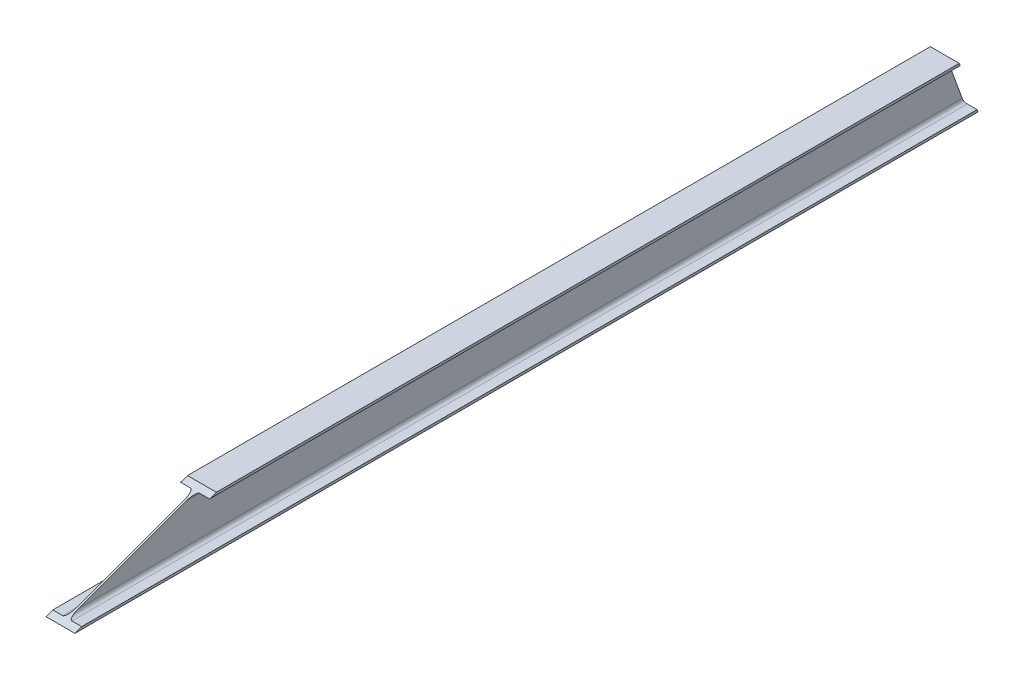
ISO-10303-21;
HEADER;
FILE_DESCRIPTION(('STEP AP214'),'2;1');
FILE_NAME('part.step','',(''),(''),'','','');
FILE_SCHEMA(('AUTOMOTIVE_DESIGN { 1 0 10303 214 1 1 1 1 }'));
ENDSEC;
DATA;
#1=APPLICATION_CONTEXT('core data for automotive mechanical design processes');
#2=APPLICATION_PROTOCOL_DEFINITION('international standard','automotive_design',2000,#1);
#3=PRODUCT_CONTEXT('',#1,'mechanical');
#4=PRODUCT('Part','Part','',(#3));
#5=PRODUCT_RELATED_PRODUCT_CATEGORY('part','',(#4));
#6=PRODUCT_DEFINITION_FORMATION('','',#4);
#7=PRODUCT_DEFINITION_CONTEXT('part definition',#1,'design');
#8=PRODUCT_DEFINITION('design','',#6,#7);
#9=PRODUCT_DEFINITION_SHAPE('','',#8);
#10=(LENGTH_UNIT() NAMED_UNIT(*) SI_UNIT(.MILLI.,.METRE.));
#11=(NAMED_UNIT(*) PLANE_ANGLE_UNIT() SI_UNIT($,.RADIAN.));
#12=(NAMED_UNIT(*) SI_UNIT($,.STERADIAN.) SOLID_ANGLE_UNIT());
#13=UNCERTAINTY_MEASURE_WITH_UNIT(LENGTH_MEASURE(1.E-05),#10,'distance_accuracy_value','');
#14=(GEOMETRIC_REPRESENTATION_CONTEXT(3) GLOBAL_UNCERTAINTY_ASSIGNED_CONTEXT((#13)) GLOBAL_UNIT_ASSIGNED_CONTEXT((#10,
#11,#12)) REPRESENTATION_CONTEXT('',''));
#15=CARTESIAN_POINT('',(0.,0.,0.));
#16=DIRECTION('',(0.,0.,1.));
#17=DIRECTION('',(1.,0.,0.));
#18=AXIS2_PLACEMENT_3D('',#15,#16,#17);
#19=CARTESIAN_POINT('',(-27.5,44.3,1726.35054737602));
#20=DIRECTION('',(1.,0.,0.));
#21=DIRECTION('',(0.,1.,0.));
#22=AXIS2_PLACEMENT_3D('',#19,#20,#21);
#23=PLANE('',#22);
#24=DIRECTION('',(0.,0.,-1.));
#25=VECTOR('',#24,1.);
#26=CARTESIAN_POINT('',(-27.5,44.3,1726.35054737602));
#27=LINE('',#26,#25);
#28=CARTESIAN_POINT('',(-27.5,44.3,1462.58444096448));
#29=VERTEX_POINT('',#28);
#30=CARTESIAN_POINT('',(-27.5,44.3,33.9584228570368));
#31=VERTEX_POINT('',#30);
#32=EDGE_CURVE('E45',#29,#31,#27,.T.);
#33=ORIENTED_EDGE('',*,*,#32,.F.);
#34=DIRECTION('',(0.,0.342020143325666,-0.939692620785909));
#35=VECTOR('',#34,1.);
#36=CARTESIAN_POINT('',(-27.5000000000001,-40.4727925282967,1695.49577422009));
#37=LINE('',#36,#35);
#38=CARTESIAN_POINT('',(-27.5,49.,1449.67129709305));
#39=VERTEX_POINT('',#38);
#40=EDGE_CURVE('E293',#29,#39,#37,.T.);
#41=ORIENTED_EDGE('',*,*,#40,.T.);
#42=DIRECTION('',(0.,0.,-1.));
#43=VECTOR('',#42,1.);
#44=CARTESIAN_POINT('',(-27.5,49.,1726.35054737602));
#45=LINE('',#44,#43);
#46=CARTESIAN_POINT('',(-27.5,49.,35.6690829580877));
#47=VERTEX_POINT('',#46);
#48=EDGE_CURVE('E202',#39,#47,#45,.T.);
#49=ORIENTED_EDGE('',*,*,#48,.T.);
#50=DIRECTION('',(0.,0.939692620785908,0.342020143325669));
#51=VECTOR('',#50,1.);
#52=CARTESIAN_POINT('',(-27.4999999999996,588.22434418594,231.930693833484));
#53=LINE('',#52,#51);
#54=EDGE_CURVE('E195',#31,#47,#53,.T.);
#55=ORIENTED_EDGE('',*,*,#54,.F.);
#56=EDGE_LOOP('',(#33,#41,#49,#55));
#57=FACE_BOUND('',#56,.T.);
#58=ADVANCED_FACE('F38',(#57),#23,.F.);
#59=CARTESIAN_POINT('',(-8.8,44.3,1726.35054737602));
#60=DIRECTION('',(0.,1.,0.));
#61=DIRECTION('',(0.,0.,1.));
#62=AXIS2_PLACEMENT_3D('',#59,#60,#61);
#63=PLANE('',#62);
#64=DIRECTION('',(0.,0.,-1.));
#65=VECTOR('',#64,1.);
#66=CARTESIAN_POINT('',(-8.8,44.3,1726.35054737602));
#67=LINE('',#66,#65);
#68=CARTESIAN_POINT('',(-8.8,44.3,1462.58444096448));
#69=VERTEX_POINT('',#68);
#70=CARTESIAN_POINT('',(-8.8,44.3,33.9584228570367));
#71=VERTEX_POINT('',#70);
#72=EDGE_CURVE('E176',#69,#71,#67,.T.);
#73=ORIENTED_EDGE('',*,*,#72,.F.);
#74=DIRECTION('',(-1.,0.,0.));
#75=VECTOR('',#74,1.);
#76=CARTESIAN_POINT('',(-8.8,44.3,1462.58444096448));
#77=LINE('',#76,#75);
#78=EDGE_CURVE('E185',#69,#29,#77,.T.);
#79=ORIENTED_EDGE('',*,*,#78,.T.);
#80=ORIENTED_EDGE('',*,*,#32,.T.);
#81=DIRECTION('',(-1.,0.,0.));
#82=VECTOR('',#81,1.);
#83=CARTESIAN_POINT('',(-8.8,44.3,33.9584228570367));
#84=LINE('',#83,#82);
#85=EDGE_CURVE('E184',#71,#31,#84,.T.);
#86=ORIENTED_EDGE('',*,*,#85,.F.);
#87=EDGE_LOOP('',(#73,#79,#80,#86));
#88=FACE_BOUND('',#87,.T.);
#89=ADVANCED_FACE('F183',(#88),#63,.F.);
#90=CARTESIAN_POINT('',(-8.8,37.3,1726.35054737602));
#91=DIRECTION('',(0.,0.,-1.));
#92=DIRECTION('',(-1.,0.,0.));
#93=AXIS2_PLACEMENT_3D('',#90,#91,#92);
#94=CYLINDRICAL_SURFACE('',#93,7.);
#95=DIRECTION('',(0.,0.,-1.));
#96=VECTOR('',#95,1.);
#97=CARTESIAN_POINT('',(-1.8,37.3,1726.35054737602));
#98=LINE('',#97,#96);
#99=CARTESIAN_POINT('',(-1.8,37.3,1481.81678290066));
#100=VERTEX_POINT('',#99);
#101=CARTESIAN_POINT('',(-1.8,37.3,31.4106312171734));
#102=VERTEX_POINT('',#101);
#103=EDGE_CURVE('E174',#100,#102,#98,.T.);
#104=ORIENTED_EDGE('',*,*,#103,.F.);
#105=CARTESIAN_POINT('',(-8.8,37.3,1481.81678290067));
#106=DIRECTION('',(0.,-0.939692620785909,-0.342020143325666));
#107=DIRECTION('',(0.,0.342020143325666,-0.939692620785909));
#108=AXIS2_PLACEMENT_3D('',#105,#106,#107);
#109=ELLIPSE('',#108,20.4666308011418,7.);
#110=EDGE_CURVE('E296',#100,#69,#109,.F.);
#111=ORIENTED_EDGE('',*,*,#110,.T.);
#112=ORIENTED_EDGE('',*,*,#72,.T.);
#113=CARTESIAN_POINT('',(-8.8,37.3,31.4106312171734));
#114=DIRECTION('',(0.,0.342020143325669,-0.939692620785908));
#115=DIRECTION('',(0.,-0.939692620785908,-0.342020143325669));
#116=AXIS2_PLACEMENT_3D('',#113,#114,#115);
#117=ELLIPSE('',#116,7.44924440733139,7.);
#118=EDGE_CURVE('E199',#102,#71,#117,.F.);
#119=ORIENTED_EDGE('',*,*,#118,.F.);
#120=EDGE_LOOP('',(#104,#111,#112,#119));
#121=FACE_BOUND('',#120,.T.);
#122=ADVANCED_FACE('F325',(#121),#94,.F.);
#123=CARTESIAN_POINT('',(-1.8,-37.3,1726.35054737602));
#124=DIRECTION('',(1.,0.,0.));
#125=DIRECTION('',(0.,0.,-1.));
#126=AXIS2_PLACEMENT_3D('',#123,#124,#125);
#127=PLANE('',#126);
#128=DIRECTION('',(0.,0.,-1.));
#129=VECTOR('',#128,1.);
#130=CARTESIAN_POINT('',(-1.8,-37.3,1726.35054737602));
#131=LINE('',#130,#129);
#132=CARTESIAN_POINT('',(-1.8,-37.3,1686.77859839198));
#133=VERTEX_POINT('',#132);
#134=CARTESIAN_POINT('',(-1.8,-37.3,4.25845174091469));
#135=VERTEX_POINT('',#134);
#136=EDGE_CURVE('E172',#133,#135,#131,.T.);
#137=ORIENTED_EDGE('',*,*,#136,.F.);
#138=DIRECTION('',(0.,0.342020143325666,-0.939692620785909));
#139=VECTOR('',#138,1.);
#140=CARTESIAN_POINT('',(-1.8,-50.0181792490422,1721.7215086953));
#141=LINE('',#140,#139);
#142=EDGE_CURVE('E299',#133,#100,#141,.T.);
#143=ORIENTED_EDGE('',*,*,#142,.T.);
#144=ORIENTED_EDGE('',*,*,#103,.T.);
#145=DIRECTION('',(0.,0.939692620785908,0.342020143325669));
#146=VECTOR('',#145,1.);
#147=CARTESIAN_POINT('',(-1.8,516.169730906686,205.704959358274));
#148=LINE('',#147,#146);
#149=EDGE_CURVE('E210',#135,#102,#148,.T.);
#150=ORIENTED_EDGE('',*,*,#149,.F.);
#151=EDGE_LOOP('',(#137,#143,#144,#150));
#152=FACE_BOUND('',#151,.T.);
#153=ADVANCED_FACE('F322',(#152),#127,.F.);
#154=CARTESIAN_POINT('',(-8.8,-37.3,1726.35054737602));
#155=DIRECTION('',(0.,0.,-1.));
#156=DIRECTION('',(-1.,0.,0.));
#157=AXIS2_PLACEMENT_3D('',#154,#155,#156);
#158=CYLINDRICAL_SURFACE('',#157,7.);
#159=DIRECTION('',(0.,0.,-1.));
#160=VECTOR('',#159,1.);
#161=CARTESIAN_POINT('',(-8.8,-44.3,1726.35054737602));
#162=LINE('',#161,#160);
#163=CARTESIAN_POINT('',(-8.8,-44.3,1706.01094032816));
#164=VERTEX_POINT('',#163);
#165=CARTESIAN_POINT('',(-8.8,-44.3,1.71066010105103));
#166=VERTEX_POINT('',#165);
#167=EDGE_CURVE('E170',#164,#166,#162,.T.);
#168=ORIENTED_EDGE('',*,*,#167,.F.);
#169=CARTESIAN_POINT('',(-8.8,-37.3,1686.77859839198));
#170=DIRECTION('',(0.,-0.939692620785909,-0.342020143325666));
#171=DIRECTION('',(0.,0.342020143325666,-0.939692620785909));
#172=AXIS2_PLACEMENT_3D('',#169,#170,#171);
#173=ELLIPSE('',#172,20.4666308011418,7.);
#174=EDGE_CURVE('E302',#164,#133,#173,.F.);
#175=ORIENTED_EDGE('',*,*,#174,.T.);
#176=ORIENTED_EDGE('',*,*,#136,.T.);
#177=CARTESIAN_POINT('',(-8.8,-37.3,4.25845174091455));
#178=DIRECTION('',(0.,0.342020143325669,-0.939692620785908));
#179=DIRECTION('',(0.,-0.939692620785908,-0.342020143325669));
#180=AXIS2_PLACEMENT_3D('',#177,#178,#179);
#181=ELLIPSE('',#180,7.44924440733139,7.);
#182=EDGE_CURVE('E212',#166,#135,#181,.F.);
#183=ORIENTED_EDGE('',*,*,#182,.F.);
#184=EDGE_LOOP('',(#168,#175,#176,#183));
#185=FACE_BOUND('',#184,.T.);
#186=ADVANCED_FACE('F319',(#185),#158,.F.);
#187=CARTESIAN_POINT('',(-27.5,-44.3,1726.35054737602));
#188=DIRECTION('',(0.,-1.,0.));
#189=DIRECTION('',(1.,0.,0.));
#190=AXIS2_PLACEMENT_3D('',#187,#188,#189);
#191=PLANE('',#190);
#192=DIRECTION('',(0.,0.,-1.));
#193=VECTOR('',#192,1.);
#194=CARTESIAN_POINT('',(-27.5,-44.3,1726.35054737602));
#195=LINE('',#194,#193);
#196=CARTESIAN_POINT('',(-27.5,-44.3,1706.01094032816));
#197=VERTEX_POINT('',#196);
#198=CARTESIAN_POINT('',(-27.5,-44.3,1.71066010105103));
#199=VERTEX_POINT('',#198);
#200=EDGE_CURVE('E163',#197,#199,#195,.T.);
#201=ORIENTED_EDGE('',*,*,#200,.F.);
#202=DIRECTION('',(1.,0.,0.));
#203=VECTOR('',#202,1.);
#204=CARTESIAN_POINT('',(-27.5,-44.3,1706.01094032816));
#205=LINE('',#204,#203);
#206=EDGE_CURVE('E305',#197,#164,#205,.T.);
#207=ORIENTED_EDGE('',*,*,#206,.T.);
#208=ORIENTED_EDGE('',*,*,#167,.T.);
#209=DIRECTION('',(1.,0.,0.));
#210=VECTOR('',#209,1.);
#211=CARTESIAN_POINT('',(-27.5000000000002,-44.3,1.71066010105103));
#212=LINE('',#211,#210);
#213=EDGE_CURVE('E215',#199,#166,#212,.T.);
#214=ORIENTED_EDGE('',*,*,#213,.F.);
#215=EDGE_LOOP('',(#201,#207,#208,#214));
#216=FACE_BOUND('',#215,.T.);
#217=ADVANCED_FACE('F314',(#216),#191,.F.);
#218=CARTESIAN_POINT('',(-27.5,-49.,1726.35054737602));
#219=DIRECTION('',(1.,0.,0.));
#220=DIRECTION('',(0.,0.,-1.));
#221=AXIS2_PLACEMENT_3D('',#218,#219,#220);
#222=PLANE('',#221);
#223=DIRECTION('',(0.,0.,-1.));
#224=VECTOR('',#223,1.);
#225=CARTESIAN_POINT('',(-27.5,-49.,1726.35054737602));
#226=LINE('',#225,#224);
#227=CARTESIAN_POINT('',(-27.5,-49.,1718.9240841996));
#228=VERTEX_POINT('',#227);
#229=CARTESIAN_POINT('',(-27.5,-49.,0.));
#230=VERTEX_POINT('',#229);
#231=EDGE_CURVE('E161',#228,#230,#226,.T.);
#232=ORIENTED_EDGE('',*,*,#231,.F.);
#233=DIRECTION('',(0.,0.342020143325666,-0.939692620785909));
#234=VECTOR('',#233,1.);
#235=CARTESIAN_POINT('',(-27.5,-51.3868192567961,1725.48181621197));
#236=LINE('',#235,#234);
#237=EDGE_CURVE('E52',#228,#197,#236,.T.);
#238=ORIENTED_EDGE('',*,*,#237,.T.);
#239=ORIENTED_EDGE('',*,*,#200,.T.);
#240=DIRECTION('',(0.,0.939692620785908,0.342020143325669));
#241=VECTOR('',#240,1.);
#242=CARTESIAN_POINT('',(-27.5,505.83837091444,201.944651841607));
#243=LINE('',#242,#241);
#244=EDGE_CURVE('E218',#230,#199,#243,.T.);
#245=ORIENTED_EDGE('',*,*,#244,.F.);
#246=EDGE_LOOP('',(#232,#238,#239,#245));
#247=FACE_BOUND('',#246,.T.);
#248=ADVANCED_FACE('F310',(#247),#222,.F.);
#249=CARTESIAN_POINT('',(27.5,-44.3,1726.35054737602));
#250=DIRECTION('',(-1.,0.,0.));
#251=DIRECTION('',(0.,0.,1.));
#252=AXIS2_PLACEMENT_3D('',#249,#250,#251);
#253=PLANE('',#252);
#254=DIRECTION('',(0.,0.,-1.));
#255=VECTOR('',#254,1.);
#256=CARTESIAN_POINT('',(27.5,-44.3,1726.35054737602));
#257=LINE('',#256,#255);
#258=CARTESIAN_POINT('',(27.5,-44.3,1706.01094032816));
#259=VERTEX_POINT('',#258);
#260=CARTESIAN_POINT('',(27.5,-44.3,1.71066010105134));
#261=VERTEX_POINT('',#260);
#262=EDGE_CURVE('E155',#259,#261,#257,.T.);
#263=ORIENTED_EDGE('',*,*,#262,.F.);
#264=DIRECTION('',(0.,-0.342020143325666,0.939692620785909));
#265=VECTOR('',#264,1.);
#266=CARTESIAN_POINT('',(27.5,-50.8370236981257,1723.9712653292));
#267=LINE('',#266,#265);
#268=CARTESIAN_POINT('',(27.5,-49.,1718.9240841996));
#269=VERTEX_POINT('',#268);
#270=EDGE_CURVE('E149',#259,#269,#267,.T.);
#271=ORIENTED_EDGE('',*,*,#270,.T.);
#272=DIRECTION('',(0.,0.,-1.));
#273=VECTOR('',#272,1.);
#274=CARTESIAN_POINT('',(27.5,-49.,1726.35054737602));
#275=LINE('',#274,#273);
#276=CARTESIAN_POINT('',(27.5,-49.,0.));
#277=VERTEX_POINT('',#276);
#278=EDGE_CURVE('E59',#269,#277,#275,.T.);
#279=ORIENTED_EDGE('',*,*,#278,.T.);
#280=DIRECTION('',(0.,-0.939692620785908,-0.342020143325669));
#281=VECTOR('',#280,1.);
#282=CARTESIAN_POINT('',(27.5,509.988575355769,203.455202724371));
#283=LINE('',#282,#281);
#284=EDGE_CURVE('E250',#261,#277,#283,.T.);
#285=ORIENTED_EDGE('',*,*,#284,.F.);
#286=EDGE_LOOP('',(#263,#271,#279,#285));
#287=FACE_BOUND('',#286,.T.);
#288=ADVANCED_FACE('F154',(#287),#253,.F.);
#289=CARTESIAN_POINT('',(8.80000000000001,-44.3,1726.35054737602));
#290=DIRECTION('',(0.,-1.,0.));
#291=DIRECTION('',(1.,0.,0.));
#292=AXIS2_PLACEMENT_3D('',#289,#290,#291);
#293=PLANE('',#292);
#294=DIRECTION('',(0.,0.,-1.));
#295=VECTOR('',#294,1.);
#296=CARTESIAN_POINT('',(8.80000000000001,-44.3,1726.35054737602));
#297=LINE('',#296,#295);
#298=CARTESIAN_POINT('',(8.80000000000001,-44.3,1706.01094032816));
#299=VERTEX_POINT('',#298);
#300=CARTESIAN_POINT('',(8.80000000000001,-44.3,1.71066010105103));
#301=VERTEX_POINT('',#300);
#302=EDGE_CURVE('E165',#299,#301,#297,.T.);
#303=ORIENTED_EDGE('',*,*,#302,.F.);
#304=DIRECTION('',(1.,0.,0.));
#305=VECTOR('',#304,1.);
#306=CARTESIAN_POINT('',(8.79999999999999,-44.3,1706.01094032816));
#307=LINE('',#306,#305);
#308=EDGE_CURVE('E252',#299,#259,#307,.T.);
#309=ORIENTED_EDGE('',*,*,#308,.T.);
#310=ORIENTED_EDGE('',*,*,#262,.T.);
#311=DIRECTION('',(1.,0.,0.));
#312=VECTOR('',#311,1.);
#313=CARTESIAN_POINT('',(8.80000000000024,-44.3,1.71066010105103));
#314=LINE('',#313,#312);
#315=EDGE_CURVE('E244',#301,#261,#314,.T.);
#316=ORIENTED_EDGE('',*,*,#315,.F.);
#317=EDGE_LOOP('',(#303,#309,#310,#316));
#318=FACE_BOUND('',#317,.T.);
#319=ADVANCED_FACE('F249',(#318),#293,.F.);
#320=CARTESIAN_POINT('',(8.80000000000001,-37.3,1726.35054737602));
#321=DIRECTION('',(0.,0.,-1.));
#322=DIRECTION('',(-1.,0.,0.));
#323=AXIS2_PLACEMENT_3D('',#320,#321,#322);
#324=CYLINDRICAL_SURFACE('',#323,7.);
#325=DIRECTION('',(0.,0.,-1.));
#326=VECTOR('',#325,1.);
#327=CARTESIAN_POINT('',(1.80000000000001,-37.3,1726.35054737602));
#328=LINE('',#327,#326);
#329=CARTESIAN_POINT('',(1.80000000000001,-37.3,1686.77859839198));
#330=VERTEX_POINT('',#329);
#331=CARTESIAN_POINT('',(1.80000000000001,-37.3,4.25845174091455));
#332=VERTEX_POINT('',#331);
#333=EDGE_CURVE('E230',#330,#332,#328,.T.);
#334=ORIENTED_EDGE('',*,*,#333,.F.);
#335=CARTESIAN_POINT('',(8.80000000000001,-37.3,1686.77859839198));
#336=DIRECTION('',(0.,-0.939692620785909,-0.342020143325666));
#337=DIRECTION('',(0.,0.342020143325666,-0.939692620785909));
#338=AXIS2_PLACEMENT_3D('',#335,#336,#337);
#339=ELLIPSE('',#338,20.4666308011418,7.);
#340=EDGE_CURVE('E239',#330,#299,#339,.F.);
#341=ORIENTED_EDGE('',*,*,#340,.T.);
#342=ORIENTED_EDGE('',*,*,#302,.T.);
#343=CARTESIAN_POINT('',(8.80000000000001,-37.3,4.25845174091455));
#344=DIRECTION('',(0.,0.342020143325669,-0.939692620785908));
#345=DIRECTION('',(0.,-0.939692620785908,-0.342020143325669));
#346=AXIS2_PLACEMENT_3D('',#343,#344,#345);
#347=ELLIPSE('',#346,7.44924440733139,7.);
#348=EDGE_CURVE('E238',#332,#301,#347,.F.);
#349=ORIENTED_EDGE('',*,*,#348,.F.);
#350=EDGE_LOOP('',(#334,#341,#342,#349));
#351=FACE_BOUND('',#350,.T.);
#352=ADVANCED_FACE('F237',(#351),#324,.F.);
#353=CARTESIAN_POINT('',(1.8,37.3,1726.35054737602));
#354=DIRECTION('',(-1.,0.,0.));
#355=DIRECTION('',(0.,-1.,0.));
#356=AXIS2_PLACEMENT_3D('',#353,#354,#355);
#357=PLANE('',#356);
#358=DIRECTION('',(0.,0.,-1.));
#359=VECTOR('',#358,1.);
#360=CARTESIAN_POINT('',(1.8,37.3,1726.35054737602));
#361=LINE('',#360,#359);
#362=CARTESIAN_POINT('',(1.8,37.3,1481.81678290067));
#363=VERTEX_POINT('',#362);
#364=CARTESIAN_POINT('',(1.8,37.3,31.4106312171735));
#365=VERTEX_POINT('',#364);
#366=EDGE_CURVE('E228',#363,#365,#361,.T.);
#367=ORIENTED_EDGE('',*,*,#366,.F.);
#368=DIRECTION('',(0.,-0.342020143325666,0.939692620785909));
#369=VECTOR('',#368,1.);
#370=CARTESIAN_POINT('',(1.80000000000001,-41.2916369773802,1697.74553085399));
#371=LINE('',#370,#369);
#372=EDGE_CURVE('E281',#363,#330,#371,.T.);
#373=ORIENTED_EDGE('',*,*,#372,.T.);
#374=ORIENTED_EDGE('',*,*,#333,.T.);
#375=DIRECTION('',(0.,-0.939692620785908,-0.342020143325669));
#376=VECTOR('',#375,1.);
#377=CARTESIAN_POINT('',(1.79999999999993,582.043188635024,229.680937199582));
#378=LINE('',#377,#376);
#379=EDGE_CURVE('E247',#365,#332,#378,.T.);
#380=ORIENTED_EDGE('',*,*,#379,.F.);
#381=EDGE_LOOP('',(#367,#373,#374,#380));
#382=FACE_BOUND('',#381,.T.);
#383=ADVANCED_FACE('F279',(#382),#357,.F.);
#384=CARTESIAN_POINT('',(8.8,37.3,1726.35054737602));
#385=DIRECTION('',(0.,0.,-1.));
#386=DIRECTION('',(-1.,0.,0.));
#387=AXIS2_PLACEMENT_3D('',#384,#385,#386);
#388=CYLINDRICAL_SURFACE('',#387,7.);
#389=DIRECTION('',(0.,0.,-1.));
#390=VECTOR('',#389,1.);
#391=CARTESIAN_POINT('',(8.8,44.3,1726.35054737602));
#392=LINE('',#391,#390);
#393=CARTESIAN_POINT('',(8.8,44.3,1462.58444096448));
#394=VERTEX_POINT('',#393);
#395=CARTESIAN_POINT('',(8.8,44.3,33.9584228570369));
#396=VERTEX_POINT('',#395);
#397=EDGE_CURVE('E226',#394,#396,#392,.T.);
#398=ORIENTED_EDGE('',*,*,#397,.F.);
#399=CARTESIAN_POINT('',(8.8,37.3,1481.81678290067));
#400=DIRECTION('',(0.,-0.939692620785909,-0.342020143325666));
#401=DIRECTION('',(0.,0.342020143325666,-0.939692620785909));
#402=AXIS2_PLACEMENT_3D('',#399,#400,#401);
#403=ELLIPSE('',#402,20.4666308011418,7.);
#404=EDGE_CURVE('E276',#394,#363,#403,.F.);
#405=ORIENTED_EDGE('',*,*,#404,.T.);
#406=ORIENTED_EDGE('',*,*,#366,.T.);
#407=CARTESIAN_POINT('',(8.8,37.3,31.4106312171734));
#408=DIRECTION('',(0.,0.342020143325669,-0.939692620785908));
#409=DIRECTION('',(0.,-0.939692620785908,-0.342020143325669));
#410=AXIS2_PLACEMENT_3D('',#407,#408,#409);
#411=ELLIPSE('',#410,7.44924440733139,7.);
#412=EDGE_CURVE('E257',#396,#365,#411,.F.);
#413=ORIENTED_EDGE('',*,*,#412,.F.);
#414=EDGE_LOOP('',(#398,#405,#406,#413));
#415=FACE_BOUND('',#414,.T.);
#416=ADVANCED_FACE('F275',(#415),#388,.F.);
#417=CARTESIAN_POINT('',(27.5,44.3,1726.35054737602));
#418=DIRECTION('',(0.,1.,0.));
#419=DIRECTION('',(0.,0.,1.));
#420=AXIS2_PLACEMENT_3D('',#417,#418,#419);
#421=PLANE('',#420);
#422=DIRECTION('',(0.,0.,-1.));
#423=VECTOR('',#422,1.);
#424=CARTESIAN_POINT('',(27.5,44.3,1726.35054737602));
#425=LINE('',#424,#423);
#426=CARTESIAN_POINT('',(27.5,44.3,1462.58444096448));
#427=VERTEX_POINT('',#426);
#428=CARTESIAN_POINT('',(27.5,44.3,33.9584228570367));
#429=VERTEX_POINT('',#428);
#430=EDGE_CURVE('E224',#427,#429,#425,.T.);
#431=ORIENTED_EDGE('',*,*,#430,.F.);
#432=DIRECTION('',(-1.,0.,0.));
#433=VECTOR('',#432,1.);
#434=CARTESIAN_POINT('',(27.5,44.3,1462.58444096448));
#435=LINE('',#434,#433);
#436=EDGE_CURVE('E272',#427,#394,#435,.T.);
#437=ORIENTED_EDGE('',*,*,#436,.T.);
#438=ORIENTED_EDGE('',*,*,#397,.T.);
#439=DIRECTION('',(-1.,0.,0.));
#440=VECTOR('',#439,1.);
#441=CARTESIAN_POINT('',(27.5,44.3,33.9584228570367));
#442=LINE('',#441,#440);
#443=EDGE_CURVE('E259',#429,#396,#442,.T.);
#444=ORIENTED_EDGE('',*,*,#443,.F.);
#445=EDGE_LOOP('',(#431,#437,#438,#444));
#446=FACE_BOUND('',#445,.T.);
#447=ADVANCED_FACE('F269',(#446),#421,.F.);
#448=CARTESIAN_POINT('',(27.5,49.,1726.35054737602));
#449=DIRECTION('',(-1.,0.,0.));
#450=DIRECTION('',(0.,0.,1.));
#451=AXIS2_PLACEMENT_3D('',#448,#449,#450);
#452=PLANE('',#451);
#453=DIRECTION('',(0.,0.,-1.));
#454=VECTOR('',#453,1.);
#455=CARTESIAN_POINT('',(27.5,49.,1726.35054737602));
#456=LINE('',#455,#454);
#457=CARTESIAN_POINT('',(27.5,49.,1449.67129709305));
#458=VERTEX_POINT('',#457);
#459=CARTESIAN_POINT('',(27.5,49.,35.6690829580879));
#460=VERTEX_POINT('',#459);
#461=EDGE_CURVE('E222',#458,#460,#456,.T.);
#462=ORIENTED_EDGE('',*,*,#461,.F.);
#463=DIRECTION('',(0.,-0.342020143325666,0.939692620785909));
#464=VECTOR('',#463,1.);
#465=CARTESIAN_POINT('',(27.5,-39.9229969696262,1693.98522333733));
#466=LINE('',#465,#464);
#467=EDGE_CURVE('E287',#458,#427,#466,.T.);
#468=ORIENTED_EDGE('',*,*,#467,.T.);
#469=ORIENTED_EDGE('',*,*,#430,.T.);
#470=DIRECTION('',(0.,-0.939692620785908,-0.342020143325669));
#471=VECTOR('',#470,1.);
#472=CARTESIAN_POINT('',(27.5,592.37454862727,233.441244716248));
#473=LINE('',#472,#471);
#474=EDGE_CURVE('E205',#460,#429,#473,.T.);
#475=ORIENTED_EDGE('',*,*,#474,.F.);
#476=EDGE_LOOP('',(#462,#468,#469,#475));
#477=FACE_BOUND('',#476,.T.);
#478=ADVANCED_FACE('F328',(#477),#452,.F.);
#479=CARTESIAN_POINT('',(-27.5,49.,1726.35054737602));
#480=DIRECTION('',(0.,-1.,0.));
#481=DIRECTION('',(0.,0.,-1.));
#482=AXIS2_PLACEMENT_3D('',#479,#480,#481);
#483=PLANE('',#482);
#484=ORIENTED_EDGE('',*,*,#48,.F.);
#485=DIRECTION('',(1.,0.,0.));
#486=VECTOR('',#485,1.);
#487=CARTESIAN_POINT('',(-27.5,49.,1449.67129709305));
#488=LINE('',#487,#486);
#489=EDGE_CURVE('E290',#39,#458,#488,.T.);
#490=ORIENTED_EDGE('',*,*,#489,.T.);
#491=ORIENTED_EDGE('',*,*,#461,.T.);
#492=DIRECTION('',(1.,0.,0.));
#493=VECTOR('',#492,1.);
#494=CARTESIAN_POINT('',(-27.5,49.,35.6690829580877));
#495=LINE('',#494,#493);
#496=EDGE_CURVE('E203',#47,#460,#495,.T.);
#497=ORIENTED_EDGE('',*,*,#496,.F.);
#498=EDGE_LOOP('',(#484,#490,#491,#497));
#499=FACE_BOUND('',#498,.T.);
#500=ADVANCED_FACE('F327',(#499),#483,.F.);
#501=CARTESIAN_POINT('',(27.5,-49.,1726.35054737602));
#502=DIRECTION('',(0.,1.,0.));
#503=DIRECTION('',(-1.,0.,0.));
#504=AXIS2_PLACEMENT_3D('',#501,#502,#503);
#505=PLANE('',#504);
#506=ORIENTED_EDGE('',*,*,#278,.F.);
#507=DIRECTION('',(-1.,0.,0.));
#508=VECTOR('',#507,1.);
#509=CARTESIAN_POINT('',(27.5,-49.,1718.9240841996));
#510=LINE('',#509,#508);
#511=EDGE_CURVE('E11',#269,#228,#510,.T.);
#512=ORIENTED_EDGE('',*,*,#511,.T.);
#513=ORIENTED_EDGE('',*,*,#231,.T.);
#514=DIRECTION('',(1.,0.,0.));
#515=VECTOR('',#514,1.);
#516=CARTESIAN_POINT('',(27.5,-49.,0.));
#517=LINE('',#516,#515);
#518=EDGE_CURVE('E160',#230,#277,#517,.T.);
#519=ORIENTED_EDGE('',*,*,#518,.T.);
#520=EDGE_LOOP('',(#506,#512,#513,#519));
#521=FACE_BOUND('',#520,.T.);
#522=ADVANCED_FACE('F158',(#521),#505,.F.);
#523=CARTESIAN_POINT('',(0.,-5.73191114358506,15.7482964373202));
#524=DIRECTION('',(0.,0.342020143325669,-0.939692620785908));
#525=DIRECTION('',(0.,0.939692620785908,0.342020143325669));
#526=AXIS2_PLACEMENT_3D('',#523,#524,#525);
#527=PLANE('',#526);
#528=ORIENTED_EDGE('',*,*,#244,.T.);
#529=ORIENTED_EDGE('',*,*,#213,.T.);
#530=ORIENTED_EDGE('',*,*,#182,.T.);
#531=ORIENTED_EDGE('',*,*,#149,.T.);
#532=ORIENTED_EDGE('',*,*,#118,.T.);
#533=ORIENTED_EDGE('',*,*,#85,.T.);
#534=ORIENTED_EDGE('',*,*,#54,.T.);
#535=ORIENTED_EDGE('',*,*,#496,.T.);
#536=ORIENTED_EDGE('',*,*,#474,.T.);
#537=ORIENTED_EDGE('',*,*,#443,.T.);
#538=ORIENTED_EDGE('',*,*,#412,.T.);
#539=ORIENTED_EDGE('',*,*,#379,.T.);
#540=ORIENTED_EDGE('',*,*,#348,.T.);
#541=ORIENTED_EDGE('',*,*,#315,.T.);
#542=ORIENTED_EDGE('',*,*,#284,.T.);
#543=ORIENTED_EDGE('',*,*,#518,.F.);
#544=EDGE_LOOP('',(#528,#529,#530,#531,#532,#533,#534,#535,#536,#537,#538,#539,#540,#541,#542,#543));
#545=FACE_BOUND('',#544,.T.);
#546=ADVANCED_FACE('F193',(#545),#527,.T.);
#547=CARTESIAN_POINT('',(0.,509.183462801224,185.327624240236));
#548=DIRECTION('',(0.,-0.939692620785909,-0.342020143325666));
#549=DIRECTION('',(0.,0.342020143325666,-0.939692620785909));
#550=AXIS2_PLACEMENT_3D('',#547,#548,#549);
#551=PLANE('',#550);
#552=ORIENTED_EDGE('',*,*,#340,.F.);
#553=ORIENTED_EDGE('',*,*,#372,.F.);
#554=ORIENTED_EDGE('',*,*,#404,.F.);
#555=ORIENTED_EDGE('',*,*,#436,.F.);
#556=ORIENTED_EDGE('',*,*,#467,.F.);
#557=ORIENTED_EDGE('',*,*,#489,.F.);
#558=ORIENTED_EDGE('',*,*,#40,.F.);
#559=ORIENTED_EDGE('',*,*,#78,.F.);
#560=ORIENTED_EDGE('',*,*,#110,.F.);
#561=ORIENTED_EDGE('',*,*,#142,.F.);
#562=ORIENTED_EDGE('',*,*,#174,.F.);
#563=ORIENTED_EDGE('',*,*,#206,.F.);
#564=ORIENTED_EDGE('',*,*,#237,.F.);
#565=ORIENTED_EDGE('',*,*,#511,.F.);
#566=ORIENTED_EDGE('',*,*,#270,.F.);
#567=ORIENTED_EDGE('',*,*,#308,.F.);
#568=EDGE_LOOP('',(#552,#553,#554,#555,#556,#557,#558,#559,#560,#561,#562,#563,#564,#565,#566,#567));
#569=FACE_BOUND('',#568,.T.);
#570=ADVANCED_FACE('F148',(#569),#551,.F.);
#571=CLOSED_SHELL('',(#58,#89,#122,#153,#186,#217,#248,#288,#319,#352,#383,#416,#447,#478,#500,
#522,#546,#570));
#572=MANIFOLD_SOLID_BREP('B2',#571);
#573=ADVANCED_BREP_SHAPE_REPRESENTATION('',(#18,#572),#14);
#574=SHAPE_DEFINITION_REPRESENTATION(#9,#573);
ENDSEC;
END-ISO-10303-21;
